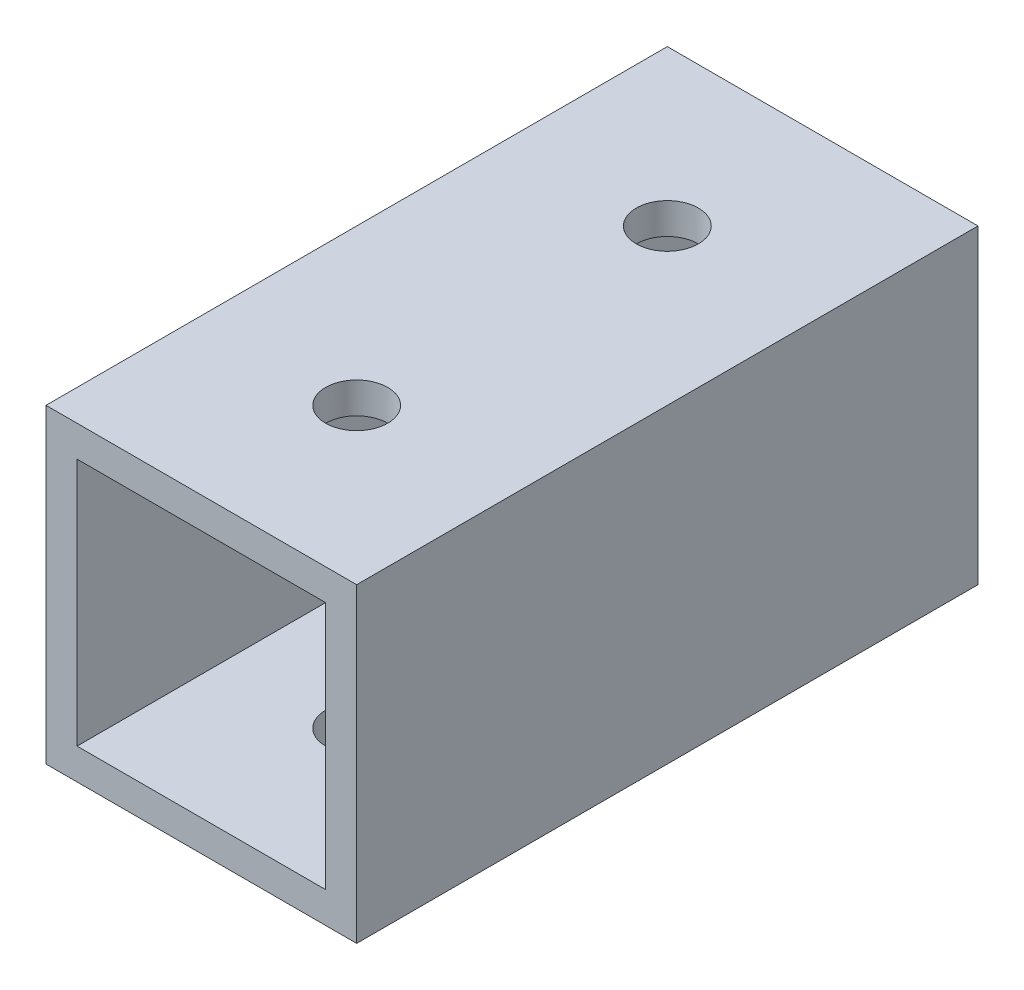
ISO-10303-21;
HEADER;
FILE_DESCRIPTION(('STEP AP214'),'2;1');
FILE_NAME('part.step','',(''),(''),'','','');
FILE_SCHEMA(('AUTOMOTIVE_DESIGN { 1 0 10303 214 1 1 1 1 }'));
ENDSEC;
DATA;
#1=APPLICATION_CONTEXT('core data for automotive mechanical design processes');
#2=APPLICATION_PROTOCOL_DEFINITION('international standard','automotive_design',2000,#1);
#3=PRODUCT_CONTEXT('',#1,'mechanical');
#4=PRODUCT('Part','Part','',(#3));
#5=PRODUCT_RELATED_PRODUCT_CATEGORY('part','',(#4));
#6=PRODUCT_DEFINITION_FORMATION('','',#4);
#7=PRODUCT_DEFINITION_CONTEXT('part definition',#1,'design');
#8=PRODUCT_DEFINITION('design','',#6,#7);
#9=PRODUCT_DEFINITION_SHAPE('','',#8);
#10=(LENGTH_UNIT() NAMED_UNIT(*) SI_UNIT(.MILLI.,.METRE.));
#11=(NAMED_UNIT(*) PLANE_ANGLE_UNIT() SI_UNIT($,.RADIAN.));
#12=(NAMED_UNIT(*) SI_UNIT($,.STERADIAN.) SOLID_ANGLE_UNIT());
#13=UNCERTAINTY_MEASURE_WITH_UNIT(LENGTH_MEASURE(1.E-05),#10,'distance_accuracy_value','');
#14=(GEOMETRIC_REPRESENTATION_CONTEXT(3) GLOBAL_UNCERTAINTY_ASSIGNED_CONTEXT((#13)) GLOBAL_UNIT_ASSIGNED_CONTEXT((#10,
#11,#12)) REPRESENTATION_CONTEXT('',''));
#15=CARTESIAN_POINT('',(0.,0.,0.));
#16=DIRECTION('',(0.,0.,1.));
#17=DIRECTION('',(1.,0.,0.));
#18=AXIS2_PLACEMENT_3D('',#15,#16,#17);
#19=CARTESIAN_POINT('',(0.,0.,30.));
#20=DIRECTION('',(0.,0.,1.));
#21=DIRECTION('',(1.,0.,0.));
#22=AXIS2_PLACEMENT_3D('',#19,#20,#21);
#23=PLANE('',#22);
#24=DIRECTION('',(0.,-1.,0.));
#25=VECTOR('',#24,1.);
#26=CARTESIAN_POINT('',(-7.01008414074451,7.73262608579252,30.));
#27=LINE('',#26,#25);
#28=CARTESIAN_POINT('',(-7.01008414074451,7.73262608579252,30.));
#29=VERTEX_POINT('',#28);
#30=CARTESIAN_POINT('',(-7.01008414074451,-7.26737391420748,30.));
#31=VERTEX_POINT('',#30);
#32=EDGE_CURVE('E137',#29,#31,#27,.T.);
#33=ORIENTED_EDGE('',*,*,#32,.T.);
#34=DIRECTION('',(1.,0.,0.));
#35=VECTOR('',#34,1.);
#36=CARTESIAN_POINT('',(-7.01008414074451,-7.26737391420748,30.));
#37=LINE('',#36,#35);
#38=CARTESIAN_POINT('',(7.98991585925548,-7.26737391420748,30.));
#39=VERTEX_POINT('',#38);
#40=EDGE_CURVE('E140',#31,#39,#37,.T.);
#41=ORIENTED_EDGE('',*,*,#40,.T.);
#42=DIRECTION('',(0.,1.,0.));
#43=VECTOR('',#42,1.);
#44=CARTESIAN_POINT('',(7.98991585925549,7.73262608579252,30.));
#45=LINE('',#44,#43);
#46=CARTESIAN_POINT('',(7.98991585925549,7.73262608579252,30.));
#47=VERTEX_POINT('',#46);
#48=EDGE_CURVE('E143',#39,#47,#45,.T.);
#49=ORIENTED_EDGE('',*,*,#48,.T.);
#50=DIRECTION('',(-1.,0.,0.));
#51=VECTOR('',#50,1.);
#52=CARTESIAN_POINT('',(-7.01008414074451,7.73262608579252,30.));
#53=LINE('',#52,#51);
#54=EDGE_CURVE('E145',#47,#29,#53,.T.);
#55=ORIENTED_EDGE('',*,*,#54,.T.);
#56=EDGE_LOOP('',(#33,#41,#49,#55));
#57=FACE_BOUND('',#56,.T.);
#58=DIRECTION('',(1.,0.,0.));
#59=VECTOR('',#58,1.);
#60=CARTESIAN_POINT('',(-5.51008414074451,-5.76737391420748,30.));
#61=LINE('',#60,#59);
#62=CARTESIAN_POINT('',(-5.51008414074451,-5.76737391420748,30.));
#63=VERTEX_POINT('',#62);
#64=CARTESIAN_POINT('',(6.48991585925549,-5.76737391420748,30.));
#65=VERTEX_POINT('',#64);
#66=EDGE_CURVE('E107',#63,#65,#61,.T.);
#67=ORIENTED_EDGE('',*,*,#66,.F.);
#68=DIRECTION('',(0.,-1.,0.));
#69=VECTOR('',#68,1.);
#70=CARTESIAN_POINT('',(-5.51008414074451,6.23262608579252,30.));
#71=LINE('',#70,#69);
#72=CARTESIAN_POINT('',(-5.51008414074451,6.23262608579252,30.));
#73=VERTEX_POINT('',#72);
#74=EDGE_CURVE('E99',#73,#63,#71,.T.);
#75=ORIENTED_EDGE('',*,*,#74,.F.);
#76=DIRECTION('',(-1.,0.,0.));
#77=VECTOR('',#76,1.);
#78=CARTESIAN_POINT('',(-5.51008414074451,6.23262608579252,30.));
#79=LINE('',#78,#77);
#80=CARTESIAN_POINT('',(6.48991585925549,6.23262608579252,30.));
#81=VERTEX_POINT('',#80);
#82=EDGE_CURVE('E121',#81,#73,#79,.T.);
#83=ORIENTED_EDGE('',*,*,#82,.F.);
#84=DIRECTION('',(0.,1.,0.));
#85=VECTOR('',#84,1.);
#86=CARTESIAN_POINT('',(6.48991585925549,6.23262608579252,30.));
#87=LINE('',#86,#85);
#88=EDGE_CURVE('E119',#65,#81,#87,.T.);
#89=ORIENTED_EDGE('',*,*,#88,.F.);
#90=EDGE_LOOP('',(#67,#75,#83,#89));
#91=FACE_BOUND('',#90,.T.);
#92=ADVANCED_FACE('F32',(#57,#91),#23,.T.);
#93=CARTESIAN_POINT('',(0.,0.,0.));
#94=DIRECTION('',(0.,0.,1.));
#95=DIRECTION('',(1.,0.,0.));
#96=AXIS2_PLACEMENT_3D('',#93,#94,#95);
#97=PLANE('',#96);
#98=DIRECTION('',(0.,-1.,0.));
#99=VECTOR('',#98,1.);
#100=CARTESIAN_POINT('',(-7.01008414074451,7.73262608579252,0.));
#101=LINE('',#100,#99);
#102=CARTESIAN_POINT('',(-7.01008414074451,7.73262608579252,0.));
#103=VERTEX_POINT('',#102);
#104=CARTESIAN_POINT('',(-7.01008414074451,-7.26737391420748,0.));
#105=VERTEX_POINT('',#104);
#106=EDGE_CURVE('E115',#103,#105,#101,.T.);
#107=ORIENTED_EDGE('',*,*,#106,.F.);
#108=DIRECTION('',(-1.,0.,0.));
#109=VECTOR('',#108,1.);
#110=CARTESIAN_POINT('',(-7.01008414074451,7.73262608579252,0.));
#111=LINE('',#110,#109);
#112=CARTESIAN_POINT('',(7.98991585925549,7.73262608579252,0.));
#113=VERTEX_POINT('',#112);
#114=EDGE_CURVE('E141',#113,#103,#111,.T.);
#115=ORIENTED_EDGE('',*,*,#114,.F.);
#116=DIRECTION('',(0.,1.,0.));
#117=VECTOR('',#116,1.);
#118=CARTESIAN_POINT('',(7.98991585925549,7.73262608579252,0.));
#119=LINE('',#118,#117);
#120=CARTESIAN_POINT('',(7.98991585925548,-7.26737391420748,0.));
#121=VERTEX_POINT('',#120);
#122=EDGE_CURVE('E152',#121,#113,#119,.T.);
#123=ORIENTED_EDGE('',*,*,#122,.F.);
#124=DIRECTION('',(1.,0.,0.));
#125=VECTOR('',#124,1.);
#126=CARTESIAN_POINT('',(-7.01008414074451,-7.26737391420748,0.));
#127=LINE('',#126,#125);
#128=EDGE_CURVE('E150',#105,#121,#127,.T.);
#129=ORIENTED_EDGE('',*,*,#128,.F.);
#130=EDGE_LOOP('',(#107,#115,#123,#129));
#131=FACE_BOUND('',#130,.T.);
#132=DIRECTION('',(0.,-1.,0.));
#133=VECTOR('',#132,1.);
#134=CARTESIAN_POINT('',(-5.51008414074451,6.23262608579252,0.));
#135=LINE('',#134,#133);
#136=CARTESIAN_POINT('',(-5.51008414074451,6.23262608579252,0.));
#137=VERTEX_POINT('',#136);
#138=CARTESIAN_POINT('',(-5.51008414074451,-5.76737391420748,0.));
#139=VERTEX_POINT('',#138);
#140=EDGE_CURVE('E57',#137,#139,#135,.T.);
#141=ORIENTED_EDGE('',*,*,#140,.T.);
#142=DIRECTION('',(1.,0.,0.));
#143=VECTOR('',#142,1.);
#144=CARTESIAN_POINT('',(-5.51008414074451,-5.76737391420748,0.));
#145=LINE('',#144,#143);
#146=CARTESIAN_POINT('',(6.48991585925549,-5.76737391420748,0.));
#147=VERTEX_POINT('',#146);
#148=EDGE_CURVE('E114',#139,#147,#145,.T.);
#149=ORIENTED_EDGE('',*,*,#148,.T.);
#150=DIRECTION('',(0.,1.,0.));
#151=VECTOR('',#150,1.);
#152=CARTESIAN_POINT('',(6.48991585925549,6.23262608579252,0.));
#153=LINE('',#152,#151);
#154=CARTESIAN_POINT('',(6.48991585925549,6.23262608579252,0.));
#155=VERTEX_POINT('',#154);
#156=EDGE_CURVE('E129',#147,#155,#153,.T.);
#157=ORIENTED_EDGE('',*,*,#156,.T.);
#158=DIRECTION('',(-1.,0.,0.));
#159=VECTOR('',#158,1.);
#160=CARTESIAN_POINT('',(-5.51008414074451,6.23262608579252,0.));
#161=LINE('',#160,#159);
#162=EDGE_CURVE('E108',#155,#137,#161,.T.);
#163=ORIENTED_EDGE('',*,*,#162,.T.);
#164=EDGE_LOOP('',(#141,#149,#157,#163));
#165=FACE_BOUND('',#164,.T.);
#166=ADVANCED_FACE('F197',(#131,#165),#97,.F.);
#167=CARTESIAN_POINT('',(-7.01008414074451,7.73262608579252,30.));
#168=DIRECTION('',(1.,0.,0.));
#169=DIRECTION('',(0.,1.,0.));
#170=AXIS2_PLACEMENT_3D('',#167,#168,#169);
#171=PLANE('',#170);
#172=ORIENTED_EDGE('',*,*,#106,.T.);
#173=DIRECTION('',(0.,0.,-1.));
#174=VECTOR('',#173,1.);
#175=CARTESIAN_POINT('',(-7.01008414074451,-7.26737391420748,30.));
#176=LINE('',#175,#174);
#177=EDGE_CURVE('E11',#31,#105,#176,.T.);
#178=ORIENTED_EDGE('',*,*,#177,.F.);
#179=ORIENTED_EDGE('',*,*,#32,.F.);
#180=DIRECTION('',(0.,0.,-1.));
#181=VECTOR('',#180,1.);
#182=CARTESIAN_POINT('',(-7.01008414074451,7.73262608579252,30.));
#183=LINE('',#182,#181);
#184=EDGE_CURVE('E147',#29,#103,#183,.T.);
#185=ORIENTED_EDGE('',*,*,#184,.T.);
#186=EDGE_LOOP('',(#172,#178,#179,#185));
#187=FACE_BOUND('',#186,.T.);
#188=ADVANCED_FACE('F34',(#187),#171,.F.);
#189=CARTESIAN_POINT('',(-7.01008414074451,-7.26737391420748,30.));
#190=DIRECTION('',(0.,1.,0.));
#191=DIRECTION('',(0.,0.,1.));
#192=AXIS2_PLACEMENT_3D('',#189,#190,#191);
#193=PLANE('',#192);
#194=CARTESIAN_POINT('',(0.489915859255486,-7.26737391420748,22.5));
#195=DIRECTION('',(0.,1.,0.));
#196=DIRECTION('',(0.,0.,1.));
#197=AXIS2_PLACEMENT_3D('',#194,#195,#196);
#198=CIRCLE('',#197,1.5);
#199=CARTESIAN_POINT('',(0.489915859255486,-7.26737391420748,24.));
#200=VERTEX_POINT('',#199);
#201=EDGE_CURVE('E127',#200,#200,#198,.T.);
#202=ORIENTED_EDGE('',*,*,#201,.T.);
#203=EDGE_LOOP('',(#202));
#204=FACE_BOUND('',#203,.T.);
#205=ORIENTED_EDGE('',*,*,#128,.T.);
#206=DIRECTION('',(0.,0.,-1.));
#207=VECTOR('',#206,1.);
#208=CARTESIAN_POINT('',(7.98991585925548,-7.26737391420748,30.));
#209=LINE('',#208,#207);
#210=EDGE_CURVE('E41',#39,#121,#209,.T.);
#211=ORIENTED_EDGE('',*,*,#210,.F.);
#212=ORIENTED_EDGE('',*,*,#40,.F.);
#213=ORIENTED_EDGE('',*,*,#177,.T.);
#214=EDGE_LOOP('',(#205,#211,#212,#213));
#215=FACE_BOUND('',#214,.T.);
#216=ADVANCED_FACE('F179',(#204,#215),#193,.F.);
#217=CARTESIAN_POINT('',(7.98991585925549,7.73262608579252,30.));
#218=DIRECTION('',(-1.,0.,0.));
#219=DIRECTION('',(0.,-1.,0.));
#220=AXIS2_PLACEMENT_3D('',#217,#218,#219);
#221=PLANE('',#220);
#222=ORIENTED_EDGE('',*,*,#122,.T.);
#223=DIRECTION('',(0.,0.,-1.));
#224=VECTOR('',#223,1.);
#225=CARTESIAN_POINT('',(7.98991585925549,7.73262608579252,30.));
#226=LINE('',#225,#224);
#227=EDGE_CURVE('E157',#47,#113,#226,.T.);
#228=ORIENTED_EDGE('',*,*,#227,.F.);
#229=ORIENTED_EDGE('',*,*,#48,.F.);
#230=ORIENTED_EDGE('',*,*,#210,.T.);
#231=EDGE_LOOP('',(#222,#228,#229,#230));
#232=FACE_BOUND('',#231,.T.);
#233=ADVANCED_FACE('F211',(#232),#221,.F.);
#234=CARTESIAN_POINT('',(-7.01008414074451,7.73262608579252,30.));
#235=DIRECTION('',(0.,-1.,0.));
#236=DIRECTION('',(0.,0.,-1.));
#237=AXIS2_PLACEMENT_3D('',#234,#235,#236);
#238=PLANE('',#237);
#239=CARTESIAN_POINT('',(0.489915859255487,7.73262608579252,7.5));
#240=DIRECTION('',(0.,1.,0.));
#241=DIRECTION('',(0.,0.,1.));
#242=AXIS2_PLACEMENT_3D('',#239,#240,#241);
#243=CIRCLE('',#242,1.5);
#244=CARTESIAN_POINT('',(0.489915859255487,7.73262608579252,9.));
#245=VERTEX_POINT('',#244);
#246=EDGE_CURVE('E174',#245,#245,#243,.T.);
#247=ORIENTED_EDGE('',*,*,#246,.F.);
#248=EDGE_LOOP('',(#247));
#249=FACE_BOUND('',#248,.T.);
#250=CARTESIAN_POINT('',(0.489915859255486,7.73262608579252,22.5));
#251=DIRECTION('',(0.,1.,0.));
#252=DIRECTION('',(0.,0.,1.));
#253=AXIS2_PLACEMENT_3D('',#250,#251,#252);
#254=CIRCLE('',#253,1.5);
#255=CARTESIAN_POINT('',(0.489915859255486,7.73262608579252,24.));
#256=VERTEX_POINT('',#255);
#257=EDGE_CURVE('E164',#256,#256,#254,.T.);
#258=ORIENTED_EDGE('',*,*,#257,.F.);
#259=EDGE_LOOP('',(#258));
#260=FACE_BOUND('',#259,.T.);
#261=ORIENTED_EDGE('',*,*,#114,.T.);
#262=ORIENTED_EDGE('',*,*,#184,.F.);
#263=ORIENTED_EDGE('',*,*,#54,.F.);
#264=ORIENTED_EDGE('',*,*,#227,.T.);
#265=EDGE_LOOP('',(#261,#262,#263,#264));
#266=FACE_BOUND('',#265,.T.);
#267=ADVANCED_FACE('F208',(#249,#260,#266),#238,.F.);
#268=CARTESIAN_POINT('',(-5.51008414074451,6.23262608579252,30.));
#269=DIRECTION('',(1.,0.,0.));
#270=DIRECTION('',(0.,1.,0.));
#271=AXIS2_PLACEMENT_3D('',#268,#269,#270);
#272=PLANE('',#271);
#273=ORIENTED_EDGE('',*,*,#140,.F.);
#274=DIRECTION('',(0.,0.,-1.));
#275=VECTOR('',#274,1.);
#276=CARTESIAN_POINT('',(-5.51008414074451,6.23262608579252,30.));
#277=LINE('',#276,#275);
#278=EDGE_CURVE('E103',#73,#137,#277,.T.);
#279=ORIENTED_EDGE('',*,*,#278,.F.);
#280=ORIENTED_EDGE('',*,*,#74,.T.);
#281=DIRECTION('',(0.,0.,-1.));
#282=VECTOR('',#281,1.);
#283=CARTESIAN_POINT('',(-5.51008414074451,-5.76737391420748,30.));
#284=LINE('',#283,#282);
#285=EDGE_CURVE('E102',#63,#139,#284,.T.);
#286=ORIENTED_EDGE('',*,*,#285,.T.);
#287=EDGE_LOOP('',(#273,#279,#280,#286));
#288=FACE_BOUND('',#287,.T.);
#289=ADVANCED_FACE('F101',(#288),#272,.T.);
#290=CARTESIAN_POINT('',(-5.51008414074451,-5.76737391420748,30.));
#291=DIRECTION('',(0.,1.,0.));
#292=DIRECTION('',(0.,0.,1.));
#293=AXIS2_PLACEMENT_3D('',#290,#291,#292);
#294=PLANE('',#293);
#295=CARTESIAN_POINT('',(0.489915859255486,-5.76737391420748,22.5));
#296=DIRECTION('',(0.,1.,0.));
#297=DIRECTION('',(0.,0.,1.));
#298=AXIS2_PLACEMENT_3D('',#295,#296,#297);
#299=CIRCLE('',#298,1.5);
#300=CARTESIAN_POINT('',(0.489915859255486,-5.76737391420748,24.));
#301=VERTEX_POINT('',#300);
#302=EDGE_CURVE('E163',#301,#301,#299,.T.);
#303=ORIENTED_EDGE('',*,*,#302,.F.);
#304=EDGE_LOOP('',(#303));
#305=FACE_BOUND('',#304,.T.);
#306=ORIENTED_EDGE('',*,*,#148,.F.);
#307=ORIENTED_EDGE('',*,*,#285,.F.);
#308=ORIENTED_EDGE('',*,*,#66,.T.);
#309=DIRECTION('',(0.,0.,-1.));
#310=VECTOR('',#309,1.);
#311=CARTESIAN_POINT('',(6.48991585925549,-5.76737391420748,30.));
#312=LINE('',#311,#310);
#313=EDGE_CURVE('E116',#65,#147,#312,.T.);
#314=ORIENTED_EDGE('',*,*,#313,.T.);
#315=EDGE_LOOP('',(#306,#307,#308,#314));
#316=FACE_BOUND('',#315,.T.);
#317=ADVANCED_FACE('F111',(#305,#316),#294,.T.);
#318=CARTESIAN_POINT('',(6.48991585925549,6.23262608579252,30.));
#319=DIRECTION('',(-1.,0.,0.));
#320=DIRECTION('',(0.,-1.,0.));
#321=AXIS2_PLACEMENT_3D('',#318,#319,#320);
#322=PLANE('',#321);
#323=ORIENTED_EDGE('',*,*,#156,.F.);
#324=ORIENTED_EDGE('',*,*,#313,.F.);
#325=ORIENTED_EDGE('',*,*,#88,.T.);
#326=DIRECTION('',(0.,0.,-1.));
#327=VECTOR('',#326,1.);
#328=CARTESIAN_POINT('',(6.48991585925549,6.23262608579252,30.));
#329=LINE('',#328,#327);
#330=EDGE_CURVE('E49',#81,#155,#329,.T.);
#331=ORIENTED_EDGE('',*,*,#330,.T.);
#332=EDGE_LOOP('',(#323,#324,#325,#331));
#333=FACE_BOUND('',#332,.T.);
#334=ADVANCED_FACE('F236',(#333),#322,.T.);
#335=CARTESIAN_POINT('',(-5.51008414074451,6.23262608579252,30.));
#336=DIRECTION('',(0.,-1.,0.));
#337=DIRECTION('',(0.,0.,-1.));
#338=AXIS2_PLACEMENT_3D('',#335,#336,#337);
#339=PLANE('',#338);
#340=CARTESIAN_POINT('',(0.489915859255487,6.23262608579252,7.5));
#341=DIRECTION('',(0.,-1.,0.));
#342=DIRECTION('',(0.,0.,-1.));
#343=AXIS2_PLACEMENT_3D('',#340,#341,#342);
#344=CIRCLE('',#343,1.5);
#345=CARTESIAN_POINT('',(0.489915859255487,6.23262608579252,6.));
#346=VERTEX_POINT('',#345);
#347=EDGE_CURVE('E36',#346,#346,#344,.T.);
#348=ORIENTED_EDGE('',*,*,#347,.F.);
#349=EDGE_LOOP('',(#348));
#350=FACE_BOUND('',#349,.T.);
#351=CARTESIAN_POINT('',(0.489915859255486,6.23262608579252,22.5));
#352=DIRECTION('',(0.,-1.,0.));
#353=DIRECTION('',(0.,0.,-1.));
#354=AXIS2_PLACEMENT_3D('',#351,#352,#353);
#355=CIRCLE('',#354,1.5);
#356=CARTESIAN_POINT('',(0.489915859255486,6.23262608579252,21.));
#357=VERTEX_POINT('',#356);
#358=EDGE_CURVE('E161',#357,#357,#355,.T.);
#359=ORIENTED_EDGE('',*,*,#358,.F.);
#360=EDGE_LOOP('',(#359));
#361=FACE_BOUND('',#360,.T.);
#362=ORIENTED_EDGE('',*,*,#162,.F.);
#363=ORIENTED_EDGE('',*,*,#330,.F.);
#364=ORIENTED_EDGE('',*,*,#82,.T.);
#365=ORIENTED_EDGE('',*,*,#278,.T.);
#366=EDGE_LOOP('',(#362,#363,#364,#365));
#367=FACE_BOUND('',#366,.T.);
#368=ADVANCED_FACE('F194',(#350,#361,#367),#339,.T.);
#369=CARTESIAN_POINT('',(0.489915859255486,-12.2673739142075,22.5));
#370=DIRECTION('',(0.,1.,0.));
#371=DIRECTION('',(0.,0.,1.));
#372=AXIS2_PLACEMENT_3D('',#369,#370,#371);
#373=CYLINDRICAL_SURFACE('',#372,1.5);
#374=ORIENTED_EDGE('',*,*,#358,.T.);
#375=EDGE_LOOP('',(#374));
#376=FACE_BOUND('',#375,.T.);
#377=ORIENTED_EDGE('',*,*,#257,.T.);
#378=EDGE_LOOP('',(#377));
#379=FACE_BOUND('',#378,.T.);
#380=ADVANCED_FACE('F185',(#376,#379),#373,.F.);
#381=ORIENTED_EDGE('',*,*,#302,.T.);
#382=EDGE_LOOP('',(#381));
#383=FACE_BOUND('',#382,.T.);
#384=ORIENTED_EDGE('',*,*,#201,.F.);
#385=EDGE_LOOP('',(#384));
#386=FACE_BOUND('',#385,.T.);
#387=ADVANCED_FACE('F182',(#383,#386),#373,.F.);
#388=CARTESIAN_POINT('',(0.489915859255487,-2.26737391420748,7.5));
#389=DIRECTION('',(0.,1.,0.));
#390=DIRECTION('',(0.,0.,1.));
#391=AXIS2_PLACEMENT_3D('',#388,#389,#390);
#392=CYLINDRICAL_SURFACE('',#391,1.5);
#393=ORIENTED_EDGE('',*,*,#347,.T.);
#394=EDGE_LOOP('',(#393));
#395=FACE_BOUND('',#394,.T.);
#396=ORIENTED_EDGE('',*,*,#246,.T.);
#397=EDGE_LOOP('',(#396));
#398=FACE_BOUND('',#397,.T.);
#399=ADVANCED_FACE('F184',(#395,#398),#392,.F.);
#400=CLOSED_SHELL('',(#92,#166,#188,#216,#233,#267,#289,#317,#334,#368,#380,#387,#399));
#401=MANIFOLD_SOLID_BREP('B2',#400);
#402=ADVANCED_BREP_SHAPE_REPRESENTATION('',(#18,#401),#14);
#403=SHAPE_DEFINITION_REPRESENTATION(#9,#402);
ENDSEC;
END-ISO-10303-21;
